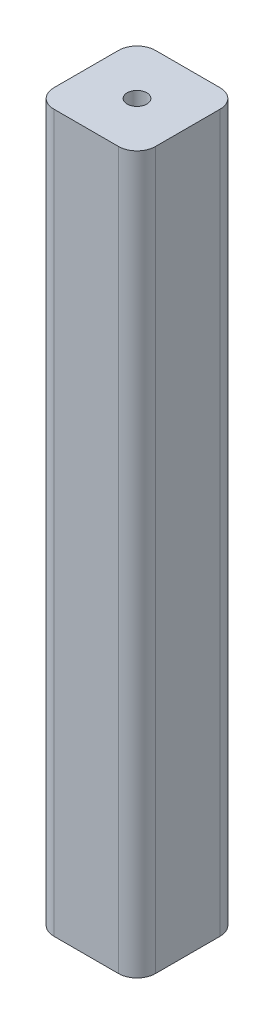
ISO-10303-21;
HEADER;
FILE_DESCRIPTION(('STEP AP214'),'2;1');
FILE_NAME('part.step','',(''),(''),'','','');
FILE_SCHEMA(('AUTOMOTIVE_DESIGN { 1 0 10303 214 1 1 1 1 }'));
ENDSEC;
DATA;
#1=APPLICATION_CONTEXT('core data for automotive mechanical design processes');
#2=APPLICATION_PROTOCOL_DEFINITION('international standard','automotive_design',2000,#1);
#3=PRODUCT_CONTEXT('',#1,'mechanical');
#4=PRODUCT('Part','Part','',(#3));
#5=PRODUCT_RELATED_PRODUCT_CATEGORY('part','',(#4));
#6=PRODUCT_DEFINITION_FORMATION('','',#4);
#7=PRODUCT_DEFINITION_CONTEXT('part definition',#1,'design');
#8=PRODUCT_DEFINITION('design','',#6,#7);
#9=PRODUCT_DEFINITION_SHAPE('','',#8);
#10=(LENGTH_UNIT() NAMED_UNIT(*) SI_UNIT(.MILLI.,.METRE.));
#11=(NAMED_UNIT(*) PLANE_ANGLE_UNIT() SI_UNIT($,.RADIAN.));
#12=(NAMED_UNIT(*) SI_UNIT($,.STERADIAN.) SOLID_ANGLE_UNIT());
#13=UNCERTAINTY_MEASURE_WITH_UNIT(LENGTH_MEASURE(1.E-05),#10,'distance_accuracy_value','');
#14=(GEOMETRIC_REPRESENTATION_CONTEXT(3) GLOBAL_UNCERTAINTY_ASSIGNED_CONTEXT((#13)) GLOBAL_UNIT_ASSIGNED_CONTEXT((#10,
#11,#12)) REPRESENTATION_CONTEXT('',''));
#15=CARTESIAN_POINT('',(0.,0.,0.));
#16=DIRECTION('',(0.,0.,1.));
#17=DIRECTION('',(1.,0.,0.));
#18=AXIS2_PLACEMENT_3D('',#15,#16,#17);
#19=CARTESIAN_POINT('',(-22.0013553738657,310.,-18.6956189701939));
#20=DIRECTION('',(1.,0.,0.));
#21=DIRECTION('',(0.,0.,-1.));
#22=AXIS2_PLACEMENT_3D('',#19,#20,#21);
#23=PLANE('',#22);
#24=DIRECTION('',(0.,0.,1.));
#25=VECTOR('',#24,1.);
#26=CARTESIAN_POINT('',(-22.0013553738657,0.,-18.6956189701939));
#27=LINE('',#26,#25);
#28=CARTESIAN_POINT('',(-22.0013553738657,0.,-10.6956189701939));
#29=VERTEX_POINT('',#28);
#30=CARTESIAN_POINT('',(-22.0013553738657,0.,17.3043810298061));
#31=VERTEX_POINT('',#30);
#32=EDGE_CURVE('E160',#29,#31,#27,.T.);
#33=ORIENTED_EDGE('',*,*,#32,.T.);
#34=DIRECTION('',(0.,-1.,0.));
#35=VECTOR('',#34,1.);
#36=CARTESIAN_POINT('',(-22.0013553738657,310.,17.3043810298061));
#37=LINE('',#36,#35);
#38=CARTESIAN_POINT('',(-22.0013553738657,310.,17.3043810298061));
#39=VERTEX_POINT('',#38);
#40=EDGE_CURVE('E197',#31,#39,#37,.F.);
#41=ORIENTED_EDGE('',*,*,#40,.T.);
#42=DIRECTION('',(0.,0.,1.));
#43=VECTOR('',#42,1.);
#44=CARTESIAN_POINT('',(-22.0013553738657,310.,-18.6956189701939));
#45=LINE('',#44,#43);
#46=CARTESIAN_POINT('',(-22.0013553738657,310.,-10.6956189701939));
#47=VERTEX_POINT('',#46);
#48=EDGE_CURVE('E161',#47,#39,#45,.T.);
#49=ORIENTED_EDGE('',*,*,#48,.F.);
#50=DIRECTION('',(0.,-1.,0.));
#51=VECTOR('',#50,1.);
#52=CARTESIAN_POINT('',(-22.0013553738657,310.,-10.6956189701939));
#53=LINE('',#52,#51);
#54=EDGE_CURVE('E194',#47,#29,#53,.T.);
#55=ORIENTED_EDGE('',*,*,#54,.T.);
#56=EDGE_LOOP('',(#33,#41,#49,#55));
#57=FACE_BOUND('',#56,.T.);
#58=ADVANCED_FACE('F42',(#57),#23,.F.);
#59=CARTESIAN_POINT('',(-22.0013553738657,310.,25.3043810298061));
#60=DIRECTION('',(0.,0.,-1.));
#61=DIRECTION('',(-1.,0.,0.));
#62=AXIS2_PLACEMENT_3D('',#59,#60,#61);
#63=PLANE('',#62);
#64=DIRECTION('',(1.,0.,0.));
#65=VECTOR('',#64,1.);
#66=CARTESIAN_POINT('',(-22.0013553738657,310.,25.3043810298061));
#67=LINE('',#66,#65);
#68=CARTESIAN_POINT('',(-14.0013553738657,310.,25.3043810298061));
#69=VERTEX_POINT('',#68);
#70=CARTESIAN_POINT('',(13.9986446261343,310.,25.3043810298061));
#71=VERTEX_POINT('',#70);
#72=EDGE_CURVE('E164',#69,#71,#67,.T.);
#73=ORIENTED_EDGE('',*,*,#72,.F.);
#74=DIRECTION('',(0.,-1.,0.));
#75=VECTOR('',#74,1.);
#76=CARTESIAN_POINT('',(-14.0013553738657,310.,25.3043810298061));
#77=LINE('',#76,#75);
#78=CARTESIAN_POINT('',(-14.0013553738657,0.,25.3043810298061));
#79=VERTEX_POINT('',#78);
#80=EDGE_CURVE('E183',#69,#79,#77,.T.);
#81=ORIENTED_EDGE('',*,*,#80,.T.);
#82=DIRECTION('',(1.,0.,0.));
#83=VECTOR('',#82,1.);
#84=CARTESIAN_POINT('',(-22.0013553738657,0.,25.3043810298061));
#85=LINE('',#84,#83);
#86=CARTESIAN_POINT('',(13.9986446261343,0.,25.3043810298061));
#87=VERTEX_POINT('',#86);
#88=EDGE_CURVE('E175',#79,#87,#85,.T.);
#89=ORIENTED_EDGE('',*,*,#88,.T.);
#90=DIRECTION('',(0.,-1.,0.));
#91=VECTOR('',#90,1.);
#92=CARTESIAN_POINT('',(13.9986446261343,310.,25.3043810298061));
#93=LINE('',#92,#91);
#94=EDGE_CURVE('E172',#87,#71,#93,.F.);
#95=ORIENTED_EDGE('',*,*,#94,.T.);
#96=EDGE_LOOP('',(#73,#81,#89,#95));
#97=FACE_BOUND('',#96,.T.);
#98=ADVANCED_FACE('F240',(#97),#63,.F.);
#99=CARTESIAN_POINT('',(21.9986446261343,310.,-18.6956189701939));
#100=DIRECTION('',(-1.,0.,0.));
#101=DIRECTION('',(0.,0.,1.));
#102=AXIS2_PLACEMENT_3D('',#99,#100,#101);
#103=PLANE('',#102);
#104=DIRECTION('',(0.,0.,-1.));
#105=VECTOR('',#104,1.);
#106=CARTESIAN_POINT('',(21.9986446261343,310.,-18.6956189701939));
#107=LINE('',#106,#105);
#108=CARTESIAN_POINT('',(21.9986446261343,310.,17.3043810298061));
#109=VERTEX_POINT('',#108);
#110=CARTESIAN_POINT('',(21.9986446261343,310.,-10.6956189701939));
#111=VERTEX_POINT('',#110);
#112=EDGE_CURVE('E168',#109,#111,#107,.T.);
#113=ORIENTED_EDGE('',*,*,#112,.F.);
#114=DIRECTION('',(0.,-1.,0.));
#115=VECTOR('',#114,1.);
#116=CARTESIAN_POINT('',(21.9986446261343,310.,17.3043810298061));
#117=LINE('',#116,#115);
#118=CARTESIAN_POINT('',(21.9986446261343,0.,17.3043810298061));
#119=VERTEX_POINT('',#118);
#120=EDGE_CURVE('E208',#109,#119,#117,.T.);
#121=ORIENTED_EDGE('',*,*,#120,.T.);
#122=DIRECTION('',(0.,0.,-1.));
#123=VECTOR('',#122,1.);
#124=CARTESIAN_POINT('',(21.9986446261343,0.,-18.6956189701939));
#125=LINE('',#124,#123);
#126=CARTESIAN_POINT('',(21.9986446261343,0.,-10.6956189701939));
#127=VERTEX_POINT('',#126);
#128=EDGE_CURVE('E178',#119,#127,#125,.T.);
#129=ORIENTED_EDGE('',*,*,#128,.T.);
#130=DIRECTION('',(0.,-1.,0.));
#131=VECTOR('',#130,1.);
#132=CARTESIAN_POINT('',(21.9986446261343,310.,-10.6956189701939));
#133=LINE('',#132,#131);
#134=EDGE_CURVE('E206',#127,#111,#133,.F.);
#135=ORIENTED_EDGE('',*,*,#134,.T.);
#136=EDGE_LOOP('',(#113,#121,#129,#135));
#137=FACE_BOUND('',#136,.T.);
#138=ADVANCED_FACE('F214',(#137),#103,.F.);
#139=CARTESIAN_POINT('',(-22.0013553738657,310.,-18.6956189701939));
#140=DIRECTION('',(0.,0.,1.));
#141=DIRECTION('',(1.,0.,0.));
#142=AXIS2_PLACEMENT_3D('',#139,#140,#141);
#143=PLANE('',#142);
#144=DIRECTION('',(-1.,0.,0.));
#145=VECTOR('',#144,1.);
#146=CARTESIAN_POINT('',(-22.0013553738657,310.,-18.6956189701939));
#147=LINE('',#146,#145);
#148=CARTESIAN_POINT('',(13.9986446261343,310.,-18.6956189701939));
#149=VERTEX_POINT('',#148);
#150=CARTESIAN_POINT('',(-14.0013553738657,310.,-18.6956189701939));
#151=VERTEX_POINT('',#150);
#152=EDGE_CURVE('E170',#149,#151,#147,.T.);
#153=ORIENTED_EDGE('',*,*,#152,.F.);
#154=DIRECTION('',(0.,-1.,0.));
#155=VECTOR('',#154,1.);
#156=CARTESIAN_POINT('',(13.9986446261343,310.,-18.6956189701939));
#157=LINE('',#156,#155);
#158=CARTESIAN_POINT('',(13.9986446261343,0.,-18.6956189701939));
#159=VERTEX_POINT('',#158);
#160=EDGE_CURVE('E11',#149,#159,#157,.T.);
#161=ORIENTED_EDGE('',*,*,#160,.T.);
#162=DIRECTION('',(-1.,0.,0.));
#163=VECTOR('',#162,1.);
#164=CARTESIAN_POINT('',(-22.0013553738657,0.,-18.6956189701939));
#165=LINE('',#164,#163);
#166=CARTESIAN_POINT('',(-14.0013553738657,0.,-18.6956189701939));
#167=VERTEX_POINT('',#166);
#168=EDGE_CURVE('E165',#159,#167,#165,.T.);
#169=ORIENTED_EDGE('',*,*,#168,.T.);
#170=DIRECTION('',(0.,-1.,0.));
#171=VECTOR('',#170,1.);
#172=CARTESIAN_POINT('',(-14.0013553738657,310.,-18.6956189701939));
#173=LINE('',#172,#171);
#174=EDGE_CURVE('E50',#167,#151,#173,.F.);
#175=ORIENTED_EDGE('',*,*,#174,.T.);
#176=EDGE_LOOP('',(#153,#161,#169,#175));
#177=FACE_BOUND('',#176,.T.);
#178=ADVANCED_FACE('F225',(#177),#143,.F.);
#179=CARTESIAN_POINT('',(0.,310.,0.));
#180=DIRECTION('',(0.,1.,0.));
#181=DIRECTION('',(0.,0.,1.));
#182=AXIS2_PLACEMENT_3D('',#179,#180,#181);
#183=PLANE('',#182);
#184=CARTESIAN_POINT('',(-0.00135537386568296,310.,3.30438102980611));
#185=DIRECTION('',(0.,1.,0.));
#186=DIRECTION('',(0.,0.,1.));
#187=AXIS2_PLACEMENT_3D('',#184,#185,#186);
#188=CIRCLE('',#187,4.24999999999999);
#189=CARTESIAN_POINT('',(-0.00135537386568296,310.,7.5543810298061));
#190=VERTEX_POINT('',#189);
#191=EDGE_CURVE('E154',#190,#190,#188,.T.);
#192=ORIENTED_EDGE('',*,*,#191,.F.);
#193=EDGE_LOOP('',(#192));
#194=FACE_BOUND('',#193,.T.);
#195=ORIENTED_EDGE('',*,*,#48,.T.);
#196=CARTESIAN_POINT('',(-14.0013553738657,310.,17.3043810298061));
#197=DIRECTION('',(0.,1.,0.));
#198=DIRECTION('',(0.,0.,1.));
#199=AXIS2_PLACEMENT_3D('',#196,#197,#198);
#200=CIRCLE('',#199,8.);
#201=EDGE_CURVE('E204',#39,#69,#200,.T.);
#202=ORIENTED_EDGE('',*,*,#201,.T.);
#203=ORIENTED_EDGE('',*,*,#72,.T.);
#204=CARTESIAN_POINT('',(13.9986446261343,310.,17.3043810298061));
#205=DIRECTION('',(0.,1.,0.));
#206=DIRECTION('',(0.,0.,1.));
#207=AXIS2_PLACEMENT_3D('',#204,#205,#206);
#208=CIRCLE('',#207,8.);
#209=EDGE_CURVE('E202',#71,#109,#208,.T.);
#210=ORIENTED_EDGE('',*,*,#209,.T.);
#211=ORIENTED_EDGE('',*,*,#112,.T.);
#212=CARTESIAN_POINT('',(13.9986446261343,310.,-10.6956189701939));
#213=DIRECTION('',(0.,1.,0.));
#214=DIRECTION('',(0.,0.,1.));
#215=AXIS2_PLACEMENT_3D('',#212,#213,#214);
#216=CIRCLE('',#215,8.);
#217=EDGE_CURVE('E63',#111,#149,#216,.T.);
#218=ORIENTED_EDGE('',*,*,#217,.T.);
#219=ORIENTED_EDGE('',*,*,#152,.T.);
#220=CARTESIAN_POINT('',(-14.0013553738657,310.,-10.6956189701939));
#221=DIRECTION('',(0.,1.,0.));
#222=DIRECTION('',(0.,0.,1.));
#223=AXIS2_PLACEMENT_3D('',#220,#221,#222);
#224=CIRCLE('',#223,8.);
#225=EDGE_CURVE('E199',#151,#47,#224,.T.);
#226=ORIENTED_EDGE('',*,*,#225,.T.);
#227=EDGE_LOOP('',(#195,#202,#203,#210,#211,#218,#219,#226));
#228=FACE_BOUND('',#227,.T.);
#229=ADVANCED_FACE('F227',(#194,#228),#183,.T.);
#230=CARTESIAN_POINT('',(0.,0.,0.));
#231=DIRECTION('',(0.,1.,0.));
#232=DIRECTION('',(0.,0.,1.));
#233=AXIS2_PLACEMENT_3D('',#230,#231,#232);
#234=PLANE('',#233);
#235=CARTESIAN_POINT('',(-13.0013553738657,0.,16.3043810298061));
#236=DIRECTION('',(0.,-1.,0.));
#237=DIRECTION('',(0.,0.,-1.));
#238=AXIS2_PLACEMENT_3D('',#235,#236,#237);
#239=CIRCLE('',#238,2.5);
#240=CARTESIAN_POINT('',(-13.0013553738657,0.,13.8043810298061));
#241=VERTEX_POINT('',#240);
#242=EDGE_CURVE('E132',#241,#241,#239,.T.);
#243=ORIENTED_EDGE('',*,*,#242,.F.);
#244=EDGE_LOOP('',(#243));
#245=FACE_BOUND('',#244,.T.);
#246=CARTESIAN_POINT('',(12.9986446261343,0.,16.3043810298061));
#247=DIRECTION('',(0.,-1.,0.));
#248=DIRECTION('',(0.,0.,-1.));
#249=AXIS2_PLACEMENT_3D('',#246,#247,#248);
#250=CIRCLE('',#249,2.5);
#251=CARTESIAN_POINT('',(12.9986446261343,0.,13.8043810298061));
#252=VERTEX_POINT('',#251);
#253=EDGE_CURVE('E131',#252,#252,#250,.T.);
#254=ORIENTED_EDGE('',*,*,#253,.F.);
#255=EDGE_LOOP('',(#254));
#256=FACE_BOUND('',#255,.T.);
#257=CARTESIAN_POINT('',(12.9986446261343,0.,-9.69561897019389));
#258=DIRECTION('',(0.,-1.,0.));
#259=DIRECTION('',(0.,0.,-1.));
#260=AXIS2_PLACEMENT_3D('',#257,#258,#259);
#261=CIRCLE('',#260,2.5);
#262=CARTESIAN_POINT('',(12.9986446261343,0.,-12.1956189701939));
#263=VERTEX_POINT('',#262);
#264=EDGE_CURVE('E142',#263,#263,#261,.T.);
#265=ORIENTED_EDGE('',*,*,#264,.F.);
#266=EDGE_LOOP('',(#265));
#267=FACE_BOUND('',#266,.T.);
#268=CARTESIAN_POINT('',(-13.0013553738657,0.,-9.69561897019389));
#269=DIRECTION('',(0.,-1.,0.));
#270=DIRECTION('',(0.,0.,-1.));
#271=AXIS2_PLACEMENT_3D('',#268,#269,#270);
#272=CIRCLE('',#271,2.5);
#273=CARTESIAN_POINT('',(-13.0013553738657,0.,-12.1956189701939));
#274=VERTEX_POINT('',#273);
#275=EDGE_CURVE('E148',#274,#274,#272,.T.);
#276=ORIENTED_EDGE('',*,*,#275,.F.);
#277=EDGE_LOOP('',(#276));
#278=FACE_BOUND('',#277,.T.);
#279=ORIENTED_EDGE('',*,*,#88,.F.);
#280=CARTESIAN_POINT('',(-14.0013553738657,0.,17.3043810298061));
#281=DIRECTION('',(0.,1.,0.));
#282=DIRECTION('',(0.,0.,1.));
#283=AXIS2_PLACEMENT_3D('',#280,#281,#282);
#284=CIRCLE('',#283,8.);
#285=EDGE_CURVE('E192',#79,#31,#284,.F.);
#286=ORIENTED_EDGE('',*,*,#285,.T.);
#287=ORIENTED_EDGE('',*,*,#32,.F.);
#288=CARTESIAN_POINT('',(-14.0013553738657,0.,-10.6956189701939));
#289=DIRECTION('',(0.,1.,0.));
#290=DIRECTION('',(0.,0.,1.));
#291=AXIS2_PLACEMENT_3D('',#288,#289,#290);
#292=CIRCLE('',#291,8.);
#293=EDGE_CURVE('E186',#29,#167,#292,.F.);
#294=ORIENTED_EDGE('',*,*,#293,.T.);
#295=ORIENTED_EDGE('',*,*,#168,.F.);
#296=CARTESIAN_POINT('',(13.9986446261343,0.,-10.6956189701939));
#297=DIRECTION('',(0.,1.,0.));
#298=DIRECTION('',(0.,0.,1.));
#299=AXIS2_PLACEMENT_3D('',#296,#297,#298);
#300=CIRCLE('',#299,8.);
#301=EDGE_CURVE('E188',#159,#127,#300,.F.);
#302=ORIENTED_EDGE('',*,*,#301,.T.);
#303=ORIENTED_EDGE('',*,*,#128,.F.);
#304=CARTESIAN_POINT('',(13.9986446261343,0.,17.3043810298061));
#305=DIRECTION('',(0.,1.,0.));
#306=DIRECTION('',(0.,0.,1.));
#307=AXIS2_PLACEMENT_3D('',#304,#305,#306);
#308=CIRCLE('',#307,8.);
#309=EDGE_CURVE('E190',#119,#87,#308,.F.);
#310=ORIENTED_EDGE('',*,*,#309,.T.);
#311=EDGE_LOOP('',(#279,#286,#287,#294,#295,#302,#303,#310));
#312=FACE_BOUND('',#311,.T.);
#313=ADVANCED_FACE('F220',(#245,#256,#267,#278,#312),#234,.F.);
#314=CARTESIAN_POINT('',(-0.00135537386568296,285.,3.30438102980611));
#315=DIRECTION('',(0.,1.,0.));
#316=DIRECTION('',(0.,0.,1.));
#317=AXIS2_PLACEMENT_3D('',#314,#315,#316);
#318=CONICAL_SURFACE('',#317,4.24999999999999,1.02974425867665);
#319=CARTESIAN_POINT('',(-0.00135537386568971,282.446342369133,3.30438102980611));
#320=VERTEX_POINT('',#319);
#321=VERTEX_LOOP('',#320);
#322=FACE_BOUND('',#321,.T.);
#323=CARTESIAN_POINT('',(-0.00135537386568296,285.,3.30438102980611));
#324=DIRECTION('',(0.,1.,0.));
#325=DIRECTION('',(0.,0.,1.));
#326=AXIS2_PLACEMENT_3D('',#323,#324,#325);
#327=CIRCLE('',#326,4.24999999999999);
#328=CARTESIAN_POINT('',(-0.00135537386568296,285.,7.55438102980611));
#329=VERTEX_POINT('',#328);
#330=EDGE_CURVE('E157',#329,#329,#327,.T.);
#331=ORIENTED_EDGE('',*,*,#330,.T.);
#332=EDGE_LOOP('',(#331));
#333=FACE_BOUND('',#332,.T.);
#334=ADVANCED_FACE('F263',(#322,#333),#318,.F.);
#335=CARTESIAN_POINT('',(-0.00135537386568296,310.,3.30438102980611));
#336=DIRECTION('',(0.,1.,0.));
#337=DIRECTION('',(0.,0.,1.));
#338=AXIS2_PLACEMENT_3D('',#335,#336,#337);
#339=CYLINDRICAL_SURFACE('',#338,4.24999999999999);
#340=ORIENTED_EDGE('',*,*,#330,.F.);
#341=EDGE_LOOP('',(#340));
#342=FACE_BOUND('',#341,.T.);
#343=ORIENTED_EDGE('',*,*,#191,.T.);
#344=EDGE_LOOP('',(#343));
#345=FACE_BOUND('',#344,.T.);
#346=ADVANCED_FACE('F270',(#342,#345),#339,.F.);
#347=CARTESIAN_POINT('',(-13.0013553738657,40.,-9.69561897019389));
#348=DIRECTION('',(0.,-1.,0.));
#349=DIRECTION('',(0.,0.,-1.));
#350=AXIS2_PLACEMENT_3D('',#347,#348,#349);
#351=CONICAL_SURFACE('',#350,2.49999999999999,1.02974425867665);
#352=CARTESIAN_POINT('',(-13.0013553738657,41.5021515475689,-9.69561897019389));
#353=VERTEX_POINT('',#352);
#354=VERTEX_LOOP('',#353);
#355=FACE_BOUND('',#354,.T.);
#356=CARTESIAN_POINT('',(-13.0013553738657,40.,-9.69561897019389));
#357=DIRECTION('',(0.,-1.,0.));
#358=DIRECTION('',(0.,0.,-1.));
#359=AXIS2_PLACEMENT_3D('',#356,#357,#358);
#360=CIRCLE('',#359,2.49999999999999);
#361=CARTESIAN_POINT('',(-13.0013553738657,40.,-12.1956189701939));
#362=VERTEX_POINT('',#361);
#363=EDGE_CURVE('E151',#362,#362,#360,.T.);
#364=ORIENTED_EDGE('',*,*,#363,.T.);
#365=EDGE_LOOP('',(#364));
#366=FACE_BOUND('',#365,.T.);
#367=ADVANCED_FACE('F274',(#355,#366),#351,.F.);
#368=CARTESIAN_POINT('',(-13.0013553738657,0.,-9.69561897019389));
#369=DIRECTION('',(0.,-1.,0.));
#370=DIRECTION('',(0.,0.,-1.));
#371=AXIS2_PLACEMENT_3D('',#368,#369,#370);
#372=CYLINDRICAL_SURFACE('',#371,2.49999999999999);
#373=ORIENTED_EDGE('',*,*,#363,.F.);
#374=EDGE_LOOP('',(#373));
#375=FACE_BOUND('',#374,.T.);
#376=ORIENTED_EDGE('',*,*,#275,.T.);
#377=EDGE_LOOP('',(#376));
#378=FACE_BOUND('',#377,.T.);
#379=ADVANCED_FACE('F278',(#375,#378),#372,.F.);
#380=CARTESIAN_POINT('',(12.9986446261343,40.,-9.69561897019389));
#381=DIRECTION('',(0.,-1.,0.));
#382=DIRECTION('',(0.,0.,-1.));
#383=AXIS2_PLACEMENT_3D('',#380,#381,#382);
#384=CONICAL_SURFACE('',#383,2.49999999999999,1.02974425867665);
#385=CARTESIAN_POINT('',(12.9986446261343,41.5021515475689,-9.69561897019389));
#386=VERTEX_POINT('',#385);
#387=VERTEX_LOOP('',#386);
#388=FACE_BOUND('',#387,.T.);
#389=CARTESIAN_POINT('',(12.9986446261343,40.,-9.69561897019389));
#390=DIRECTION('',(0.,-1.,0.));
#391=DIRECTION('',(0.,0.,-1.));
#392=AXIS2_PLACEMENT_3D('',#389,#390,#391);
#393=CIRCLE('',#392,2.49999999999999);
#394=CARTESIAN_POINT('',(12.9986446261343,40.,-12.1956189701939));
#395=VERTEX_POINT('',#394);
#396=EDGE_CURVE('E145',#395,#395,#393,.T.);
#397=ORIENTED_EDGE('',*,*,#396,.T.);
#398=EDGE_LOOP('',(#397));
#399=FACE_BOUND('',#398,.T.);
#400=ADVANCED_FACE('F282',(#388,#399),#384,.F.);
#401=CARTESIAN_POINT('',(12.9986446261343,0.,-9.69561897019389));
#402=DIRECTION('',(0.,-1.,0.));
#403=DIRECTION('',(0.,0.,-1.));
#404=AXIS2_PLACEMENT_3D('',#401,#402,#403);
#405=CYLINDRICAL_SURFACE('',#404,2.49999999999999);
#406=ORIENTED_EDGE('',*,*,#396,.F.);
#407=EDGE_LOOP('',(#406));
#408=FACE_BOUND('',#407,.T.);
#409=ORIENTED_EDGE('',*,*,#264,.T.);
#410=EDGE_LOOP('',(#409));
#411=FACE_BOUND('',#410,.T.);
#412=ADVANCED_FACE('F286',(#408,#411),#405,.F.);
#413=CARTESIAN_POINT('',(12.9986446261343,40.,16.3043810298061));
#414=DIRECTION('',(0.,-1.,0.));
#415=DIRECTION('',(0.,0.,-1.));
#416=AXIS2_PLACEMENT_3D('',#413,#414,#415);
#417=CONICAL_SURFACE('',#416,2.49999999999999,1.02974425867665);
#418=CARTESIAN_POINT('',(12.9986446261343,41.5021515475689,16.3043810298061));
#419=VERTEX_POINT('',#418);
#420=VERTEX_LOOP('',#419);
#421=FACE_BOUND('',#420,.T.);
#422=CARTESIAN_POINT('',(12.9986446261343,40.,16.3043810298061));
#423=DIRECTION('',(0.,-1.,0.));
#424=DIRECTION('',(0.,0.,-1.));
#425=AXIS2_PLACEMENT_3D('',#422,#423,#424);
#426=CIRCLE('',#425,2.49999999999999);
#427=CARTESIAN_POINT('',(12.9986446261343,40.,13.8043810298061));
#428=VERTEX_POINT('',#427);
#429=EDGE_CURVE('E135',#428,#428,#426,.T.);
#430=ORIENTED_EDGE('',*,*,#429,.T.);
#431=EDGE_LOOP('',(#430));
#432=FACE_BOUND('',#431,.T.);
#433=ADVANCED_FACE('F290',(#421,#432),#417,.F.);
#434=CARTESIAN_POINT('',(12.9986446261343,0.,16.3043810298061));
#435=DIRECTION('',(0.,-1.,0.));
#436=DIRECTION('',(0.,0.,-1.));
#437=AXIS2_PLACEMENT_3D('',#434,#435,#436);
#438=CYLINDRICAL_SURFACE('',#437,2.49999999999999);
#439=ORIENTED_EDGE('',*,*,#429,.F.);
#440=EDGE_LOOP('',(#439));
#441=FACE_BOUND('',#440,.T.);
#442=ORIENTED_EDGE('',*,*,#253,.T.);
#443=EDGE_LOOP('',(#442));
#444=FACE_BOUND('',#443,.T.);
#445=ADVANCED_FACE('F125',(#441,#444),#438,.F.);
#446=CARTESIAN_POINT('',(-13.0013553738657,40.,16.3043810298061));
#447=DIRECTION('',(0.,-1.,0.));
#448=DIRECTION('',(0.,0.,-1.));
#449=AXIS2_PLACEMENT_3D('',#446,#447,#448);
#450=CONICAL_SURFACE('',#449,2.49999999999999,1.02974425867665);
#451=CARTESIAN_POINT('',(-13.0013553738657,41.5021515475689,16.3043810298061));
#452=VERTEX_POINT('',#451);
#453=VERTEX_LOOP('',#452);
#454=FACE_BOUND('',#453,.T.);
#455=CARTESIAN_POINT('',(-13.0013553738657,40.,16.3043810298061));
#456=DIRECTION('',(0.,-1.,0.));
#457=DIRECTION('',(0.,0.,-1.));
#458=AXIS2_PLACEMENT_3D('',#455,#456,#457);
#459=CIRCLE('',#458,2.49999999999999);
#460=CARTESIAN_POINT('',(-13.0013553738657,40.,13.8043810298061));
#461=VERTEX_POINT('',#460);
#462=EDGE_CURVE('E129',#461,#461,#459,.T.);
#463=ORIENTED_EDGE('',*,*,#462,.T.);
#464=EDGE_LOOP('',(#463));
#465=FACE_BOUND('',#464,.T.);
#466=ADVANCED_FACE('F121',(#454,#465),#450,.F.);
#467=CARTESIAN_POINT('',(-13.0013553738657,0.,16.3043810298061));
#468=DIRECTION('',(0.,-1.,0.));
#469=DIRECTION('',(0.,0.,-1.));
#470=AXIS2_PLACEMENT_3D('',#467,#468,#469);
#471=CYLINDRICAL_SURFACE('',#470,2.49999999999999);
#472=ORIENTED_EDGE('',*,*,#462,.F.);
#473=EDGE_LOOP('',(#472));
#474=FACE_BOUND('',#473,.T.);
#475=ORIENTED_EDGE('',*,*,#242,.T.);
#476=EDGE_LOOP('',(#475));
#477=FACE_BOUND('',#476,.T.);
#478=ADVANCED_FACE('F124',(#474,#477),#471,.F.);
#479=CARTESIAN_POINT('',(-14.0013553738657,310.,17.3043810298061));
#480=DIRECTION('',(0.,-1.,0.));
#481=DIRECTION('',(0.,0.,-1.));
#482=AXIS2_PLACEMENT_3D('',#479,#480,#481);
#483=CYLINDRICAL_SURFACE('',#482,8.);
#484=ORIENTED_EDGE('',*,*,#201,.F.);
#485=ORIENTED_EDGE('',*,*,#40,.F.);
#486=ORIENTED_EDGE('',*,*,#285,.F.);
#487=ORIENTED_EDGE('',*,*,#80,.F.);
#488=EDGE_LOOP('',(#484,#485,#486,#487));
#489=FACE_BOUND('',#488,.T.);
#490=ADVANCED_FACE('F237',(#489),#483,.T.);
#491=CARTESIAN_POINT('',(13.9986446261343,310.,17.3043810298061));
#492=DIRECTION('',(0.,-1.,0.));
#493=DIRECTION('',(0.,0.,-1.));
#494=AXIS2_PLACEMENT_3D('',#491,#492,#493);
#495=CYLINDRICAL_SURFACE('',#494,8.);
#496=ORIENTED_EDGE('',*,*,#209,.F.);
#497=ORIENTED_EDGE('',*,*,#94,.F.);
#498=ORIENTED_EDGE('',*,*,#309,.F.);
#499=ORIENTED_EDGE('',*,*,#120,.F.);
#500=EDGE_LOOP('',(#496,#497,#498,#499));
#501=FACE_BOUND('',#500,.T.);
#502=ADVANCED_FACE('F242',(#501),#495,.T.);
#503=CARTESIAN_POINT('',(13.9986446261343,310.,-10.6956189701939));
#504=DIRECTION('',(0.,-1.,0.));
#505=DIRECTION('',(0.,0.,-1.));
#506=AXIS2_PLACEMENT_3D('',#503,#504,#505);
#507=CYLINDRICAL_SURFACE('',#506,8.);
#508=ORIENTED_EDGE('',*,*,#217,.F.);
#509=ORIENTED_EDGE('',*,*,#134,.F.);
#510=ORIENTED_EDGE('',*,*,#301,.F.);
#511=ORIENTED_EDGE('',*,*,#160,.F.);
#512=EDGE_LOOP('',(#508,#509,#510,#511));
#513=FACE_BOUND('',#512,.T.);
#514=ADVANCED_FACE('F224',(#513),#507,.T.);
#515=CARTESIAN_POINT('',(-14.0013553738657,310.,-10.6956189701939));
#516=DIRECTION('',(0.,-1.,0.));
#517=DIRECTION('',(0.,0.,-1.));
#518=AXIS2_PLACEMENT_3D('',#515,#516,#517);
#519=CYLINDRICAL_SURFACE('',#518,8.);
#520=ORIENTED_EDGE('',*,*,#225,.F.);
#521=ORIENTED_EDGE('',*,*,#174,.F.);
#522=ORIENTED_EDGE('',*,*,#293,.F.);
#523=ORIENTED_EDGE('',*,*,#54,.F.);
#524=EDGE_LOOP('',(#520,#521,#522,#523));
#525=FACE_BOUND('',#524,.T.);
#526=ADVANCED_FACE('F44',(#525),#519,.T.);
#527=CLOSED_SHELL('',(#58,#98,#138,#178,#229,#313,#334,#346,#367,#379,#400,#412,#433,#445,#466,
#478,#490,#502,#514,#526));
#528=MANIFOLD_SOLID_BREP('B2',#527);
#529=ADVANCED_BREP_SHAPE_REPRESENTATION('',(#18,#528),#14);
#530=SHAPE_DEFINITION_REPRESENTATION(#9,#529);
ENDSEC;
END-ISO-10303-21;
